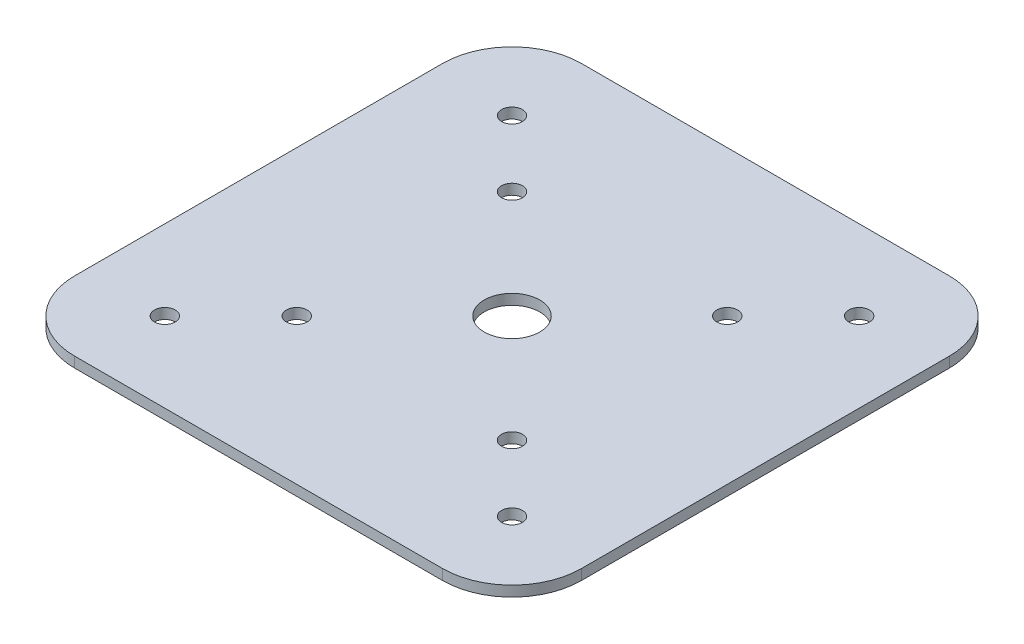
ISO-10303-21;
HEADER;
FILE_DESCRIPTION(('STEP AP214'),'2;1');
FILE_NAME('part.step','',(''),(''),'','','');
FILE_SCHEMA(('AUTOMOTIVE_DESIGN { 1 0 10303 214 1 1 1 1 }'));
ENDSEC;
DATA;
#1=APPLICATION_CONTEXT('core data for automotive mechanical design processes');
#2=APPLICATION_PROTOCOL_DEFINITION('international standard','automotive_design',2000,#1);
#3=PRODUCT_CONTEXT('',#1,'mechanical');
#4=PRODUCT('Part','Part','',(#3));
#5=PRODUCT_RELATED_PRODUCT_CATEGORY('part','',(#4));
#6=PRODUCT_DEFINITION_FORMATION('','',#4);
#7=PRODUCT_DEFINITION_CONTEXT('part definition',#1,'design');
#8=PRODUCT_DEFINITION('design','',#6,#7);
#9=PRODUCT_DEFINITION_SHAPE('','',#8);
#10=(LENGTH_UNIT() NAMED_UNIT(*) SI_UNIT(.MILLI.,.METRE.));
#11=(NAMED_UNIT(*) PLANE_ANGLE_UNIT() SI_UNIT($,.RADIAN.));
#12=(NAMED_UNIT(*) SI_UNIT($,.STERADIAN.) SOLID_ANGLE_UNIT());
#13=UNCERTAINTY_MEASURE_WITH_UNIT(LENGTH_MEASURE(1.E-05),#10,'distance_accuracy_value','');
#14=(GEOMETRIC_REPRESENTATION_CONTEXT(3) GLOBAL_UNCERTAINTY_ASSIGNED_CONTEXT((#13)) GLOBAL_UNIT_ASSIGNED_CONTEXT((#10,
#11,#12)) REPRESENTATION_CONTEXT('',''));
#15=CARTESIAN_POINT('',(0.,0.,0.));
#16=DIRECTION('',(0.,0.,1.));
#17=DIRECTION('',(1.,0.,0.));
#18=AXIS2_PLACEMENT_3D('',#15,#16,#17);
#19=CARTESIAN_POINT('',(0.,1.5,0.));
#20=DIRECTION('',(0.,1.,0.));
#21=DIRECTION('',(0.,0.,1.));
#22=AXIS2_PLACEMENT_3D('',#19,#20,#21);
#23=PLANE('',#22);
#24=CARTESIAN_POINT('',(-25.,1.5,25.));
#25=DIRECTION('',(0.,1.,0.));
#26=DIRECTION('',(0.,0.,1.));
#27=AXIS2_PLACEMENT_3D('',#24,#25,#26);
#28=CIRCLE('',#27,1.50000000000033);
#29=CARTESIAN_POINT('',(-25.,1.5,26.5000000000003));
#30=VERTEX_POINT('',#29);
#31=EDGE_CURVE('E259',#30,#30,#28,.T.);
#32=ORIENTED_EDGE('',*,*,#31,.F.);
#33=EDGE_LOOP('',(#32));
#34=FACE_BOUND('',#33,.T.);
#35=CARTESIAN_POINT('',(25.,1.5,25.));
#36=DIRECTION('',(0.,1.,0.));
#37=DIRECTION('',(0.,0.,1.));
#38=AXIS2_PLACEMENT_3D('',#35,#36,#37);
#39=CIRCLE('',#38,1.50000000000022);
#40=CARTESIAN_POINT('',(25.,1.5,26.5000000000002));
#41=VERTEX_POINT('',#40);
#42=EDGE_CURVE('E267',#41,#41,#39,.T.);
#43=ORIENTED_EDGE('',*,*,#42,.F.);
#44=EDGE_LOOP('',(#43));
#45=FACE_BOUND('',#44,.T.);
#46=CARTESIAN_POINT('',(25.,1.5,-25.));
#47=DIRECTION('',(0.,1.,0.));
#48=DIRECTION('',(0.,0.,1.));
#49=AXIS2_PLACEMENT_3D('',#46,#47,#48);
#50=CIRCLE('',#49,1.50000000000011);
#51=CARTESIAN_POINT('',(25.,1.5,-23.4999999999999));
#52=VERTEX_POINT('',#51);
#53=EDGE_CURVE('E275',#52,#52,#50,.T.);
#54=ORIENTED_EDGE('',*,*,#53,.F.);
#55=EDGE_LOOP('',(#54));
#56=FACE_BOUND('',#55,.T.);
#57=CARTESIAN_POINT('',(-25.,1.5,-25.));
#58=DIRECTION('',(0.,1.,0.));
#59=DIRECTION('',(0.,0.,1.));
#60=AXIS2_PLACEMENT_3D('',#57,#58,#59);
#61=CIRCLE('',#60,1.5);
#62=CARTESIAN_POINT('',(-25.,1.5,-23.5));
#63=VERTEX_POINT('',#62);
#64=EDGE_CURVE('E251',#63,#63,#61,.T.);
#65=ORIENTED_EDGE('',*,*,#64,.F.);
#66=EDGE_LOOP('',(#65));
#67=FACE_BOUND('',#66,.T.);
#68=CARTESIAN_POINT('',(-15.5,1.5,15.5));
#69=DIRECTION('',(0.,1.,0.));
#70=DIRECTION('',(0.,0.,1.));
#71=AXIS2_PLACEMENT_3D('',#68,#69,#70);
#72=CIRCLE('',#71,1.50000000000021);
#73=CARTESIAN_POINT('',(-15.5,1.5,17.0000000000002));
#74=VERTEX_POINT('',#73);
#75=EDGE_CURVE('E227',#74,#74,#72,.T.);
#76=ORIENTED_EDGE('',*,*,#75,.F.);
#77=EDGE_LOOP('',(#76));
#78=FACE_BOUND('',#77,.T.);
#79=CARTESIAN_POINT('',(15.5,1.5,15.5));
#80=DIRECTION('',(0.,1.,0.));
#81=DIRECTION('',(0.,0.,1.));
#82=AXIS2_PLACEMENT_3D('',#79,#80,#81);
#83=CIRCLE('',#82,1.50000000000014);
#84=CARTESIAN_POINT('',(15.5,1.5,17.0000000000001));
#85=VERTEX_POINT('',#84);
#86=EDGE_CURVE('E236',#85,#85,#83,.T.);
#87=ORIENTED_EDGE('',*,*,#86,.F.);
#88=EDGE_LOOP('',(#87));
#89=FACE_BOUND('',#88,.T.);
#90=CARTESIAN_POINT('',(15.5,1.5,-15.5));
#91=DIRECTION('',(0.,1.,0.));
#92=DIRECTION('',(0.,0.,1.));
#93=AXIS2_PLACEMENT_3D('',#90,#91,#92);
#94=CIRCLE('',#93,1.50000000000007);
#95=CARTESIAN_POINT('',(15.5,1.5,-13.9999999999999));
#96=VERTEX_POINT('',#95);
#97=EDGE_CURVE('E244',#96,#96,#94,.T.);
#98=ORIENTED_EDGE('',*,*,#97,.F.);
#99=EDGE_LOOP('',(#98));
#100=FACE_BOUND('',#99,.T.);
#101=CARTESIAN_POINT('',(-15.5,1.5,-15.5));
#102=DIRECTION('',(0.,1.,0.));
#103=DIRECTION('',(0.,0.,1.));
#104=AXIS2_PLACEMENT_3D('',#101,#102,#103);
#105=CIRCLE('',#104,1.5);
#106=CARTESIAN_POINT('',(-15.5,1.5,-14.));
#107=VERTEX_POINT('',#106);
#108=EDGE_CURVE('E219',#107,#107,#105,.T.);
#109=ORIENTED_EDGE('',*,*,#108,.F.);
#110=EDGE_LOOP('',(#109));
#111=FACE_BOUND('',#110,.T.);
#112=DIRECTION('',(1.,0.,0.));
#113=VECTOR('',#112,1.);
#114=CARTESIAN_POINT('',(-36.5,1.5,36.5));
#115=LINE('',#114,#113);
#116=CARTESIAN_POINT('',(-26.5,1.5,36.5));
#117=VERTEX_POINT('',#116);
#118=CARTESIAN_POINT('',(26.5,1.5,36.5));
#119=VERTEX_POINT('',#118);
#120=EDGE_CURVE('E149',#117,#119,#115,.T.);
#121=ORIENTED_EDGE('',*,*,#120,.T.);
#122=CARTESIAN_POINT('',(26.5,1.5,26.5));
#123=DIRECTION('',(0.,1.,0.));
#124=DIRECTION('',(0.,0.,1.));
#125=AXIS2_PLACEMENT_3D('',#122,#123,#124);
#126=CIRCLE('',#125,10.);
#127=CARTESIAN_POINT('',(36.5,1.5,26.5));
#128=VERTEX_POINT('',#127);
#129=EDGE_CURVE('E178',#119,#128,#126,.T.);
#130=ORIENTED_EDGE('',*,*,#129,.T.);
#131=DIRECTION('',(0.,0.,-1.));
#132=VECTOR('',#131,1.);
#133=CARTESIAN_POINT('',(36.5,1.5,-36.5));
#134=LINE('',#133,#132);
#135=CARTESIAN_POINT('',(36.5,1.5,-26.5));
#136=VERTEX_POINT('',#135);
#137=EDGE_CURVE('E127',#128,#136,#134,.T.);
#138=ORIENTED_EDGE('',*,*,#137,.T.);
#139=CARTESIAN_POINT('',(26.5,1.5,-26.5));
#140=DIRECTION('',(0.,1.,0.));
#141=DIRECTION('',(0.,0.,1.));
#142=AXIS2_PLACEMENT_3D('',#139,#140,#141);
#143=CIRCLE('',#142,10.);
#144=CARTESIAN_POINT('',(26.5,1.5,-36.5));
#145=VERTEX_POINT('',#144);
#146=EDGE_CURVE('E172',#136,#145,#143,.T.);
#147=ORIENTED_EDGE('',*,*,#146,.T.);
#148=DIRECTION('',(-1.,0.,0.));
#149=VECTOR('',#148,1.);
#150=CARTESIAN_POINT('',(-36.5,1.5,-36.5));
#151=LINE('',#150,#149);
#152=CARTESIAN_POINT('',(-26.5,1.5,-36.5));
#153=VERTEX_POINT('',#152);
#154=EDGE_CURVE('E191',#145,#153,#151,.T.);
#155=ORIENTED_EDGE('',*,*,#154,.T.);
#156=CARTESIAN_POINT('',(-26.5,1.5,-26.5));
#157=DIRECTION('',(0.,1.,0.));
#158=DIRECTION('',(0.,0.,1.));
#159=AXIS2_PLACEMENT_3D('',#156,#157,#158);
#160=CIRCLE('',#159,10.);
#161=CARTESIAN_POINT('',(-36.5,1.5,-26.5));
#162=VERTEX_POINT('',#161);
#163=EDGE_CURVE('E61',#153,#162,#160,.T.);
#164=ORIENTED_EDGE('',*,*,#163,.T.);
#165=DIRECTION('',(0.,0.,1.));
#166=VECTOR('',#165,1.);
#167=CARTESIAN_POINT('',(-36.5,1.5,-36.5));
#168=LINE('',#167,#166);
#169=CARTESIAN_POINT('',(-36.5,1.5,26.5));
#170=VERTEX_POINT('',#169);
#171=EDGE_CURVE('E198',#162,#170,#168,.T.);
#172=ORIENTED_EDGE('',*,*,#171,.T.);
#173=CARTESIAN_POINT('',(-26.5,1.5,26.5));
#174=DIRECTION('',(0.,1.,0.));
#175=DIRECTION('',(0.,0.,1.));
#176=AXIS2_PLACEMENT_3D('',#173,#174,#175);
#177=CIRCLE('',#176,10.);
#178=EDGE_CURVE('E175',#170,#117,#177,.T.);
#179=ORIENTED_EDGE('',*,*,#178,.T.);
#180=EDGE_LOOP('',(#121,#130,#138,#147,#155,#164,#172,#179));
#181=FACE_BOUND('',#180,.T.);
#182=CARTESIAN_POINT('',(0.,1.5,0.));
#183=DIRECTION('',(0.,1.,0.));
#184=DIRECTION('',(0.,0.,1.));
#185=AXIS2_PLACEMENT_3D('',#182,#183,#184);
#186=CIRCLE('',#185,4.);
#187=CARTESIAN_POINT('',(0.,1.5,4.00000000000001));
#188=VERTEX_POINT('',#187);
#189=EDGE_CURVE('E138',#188,#188,#186,.T.);
#190=ORIENTED_EDGE('',*,*,#189,.F.);
#191=EDGE_LOOP('',(#190));
#192=FACE_BOUND('',#191,.T.);
#193=ADVANCED_FACE('F38',(#34,#45,#56,#67,#78,#89,#100,#111,#181,#192),#23,.T.);
#194=CARTESIAN_POINT('',(0.,0.,0.));
#195=DIRECTION('',(0.,1.,0.));
#196=DIRECTION('',(0.,0.,1.));
#197=AXIS2_PLACEMENT_3D('',#194,#195,#196);
#198=PLANE('',#197);
#199=CARTESIAN_POINT('',(-25.,0.,25.));
#200=DIRECTION('',(0.,1.,0.));
#201=DIRECTION('',(0.,0.,1.));
#202=AXIS2_PLACEMENT_3D('',#199,#200,#201);
#203=CIRCLE('',#202,1.50000000000033);
#204=CARTESIAN_POINT('',(-25.,0.,26.5000000000003));
#205=VERTEX_POINT('',#204);
#206=EDGE_CURVE('E263',#205,#205,#203,.T.);
#207=ORIENTED_EDGE('',*,*,#206,.T.);
#208=EDGE_LOOP('',(#207));
#209=FACE_BOUND('',#208,.T.);
#210=CARTESIAN_POINT('',(25.,0.,25.));
#211=DIRECTION('',(0.,1.,0.));
#212=DIRECTION('',(0.,0.,1.));
#213=AXIS2_PLACEMENT_3D('',#210,#211,#212);
#214=CIRCLE('',#213,1.50000000000022);
#215=CARTESIAN_POINT('',(25.,0.,26.5000000000002));
#216=VERTEX_POINT('',#215);
#217=EDGE_CURVE('E271',#216,#216,#214,.T.);
#218=ORIENTED_EDGE('',*,*,#217,.T.);
#219=EDGE_LOOP('',(#218));
#220=FACE_BOUND('',#219,.T.);
#221=CARTESIAN_POINT('',(25.,0.,-25.));
#222=DIRECTION('',(0.,1.,0.));
#223=DIRECTION('',(0.,0.,1.));
#224=AXIS2_PLACEMENT_3D('',#221,#222,#223);
#225=CIRCLE('',#224,1.50000000000011);
#226=CARTESIAN_POINT('',(25.,0.,-23.4999999999999));
#227=VERTEX_POINT('',#226);
#228=EDGE_CURVE('E255',#227,#227,#225,.T.);
#229=ORIENTED_EDGE('',*,*,#228,.T.);
#230=EDGE_LOOP('',(#229));
#231=FACE_BOUND('',#230,.T.);
#232=CARTESIAN_POINT('',(-25.,0.,-25.));
#233=DIRECTION('',(0.,1.,0.));
#234=DIRECTION('',(0.,0.,1.));
#235=AXIS2_PLACEMENT_3D('',#232,#233,#234);
#236=CIRCLE('',#235,1.5);
#237=CARTESIAN_POINT('',(-25.,0.,-23.5));
#238=VERTEX_POINT('',#237);
#239=EDGE_CURVE('E232',#238,#238,#236,.T.);
#240=ORIENTED_EDGE('',*,*,#239,.T.);
#241=EDGE_LOOP('',(#240));
#242=FACE_BOUND('',#241,.T.);
#243=CARTESIAN_POINT('',(-15.5,0.,15.5));
#244=DIRECTION('',(0.,1.,0.));
#245=DIRECTION('',(0.,0.,1.));
#246=AXIS2_PLACEMENT_3D('',#243,#244,#245);
#247=CIRCLE('',#246,1.50000000000021);
#248=CARTESIAN_POINT('',(-15.5,0.,17.0000000000002));
#249=VERTEX_POINT('',#248);
#250=EDGE_CURVE('E231',#249,#249,#247,.T.);
#251=ORIENTED_EDGE('',*,*,#250,.T.);
#252=EDGE_LOOP('',(#251));
#253=FACE_BOUND('',#252,.T.);
#254=CARTESIAN_POINT('',(15.5,0.,15.5));
#255=DIRECTION('',(0.,1.,0.));
#256=DIRECTION('',(0.,0.,1.));
#257=AXIS2_PLACEMENT_3D('',#254,#255,#256);
#258=CIRCLE('',#257,1.50000000000014);
#259=CARTESIAN_POINT('',(15.5,0.,17.0000000000001));
#260=VERTEX_POINT('',#259);
#261=EDGE_CURVE('E240',#260,#260,#258,.T.);
#262=ORIENTED_EDGE('',*,*,#261,.T.);
#263=EDGE_LOOP('',(#262));
#264=FACE_BOUND('',#263,.T.);
#265=CARTESIAN_POINT('',(15.5,0.,-15.5));
#266=DIRECTION('',(0.,1.,0.));
#267=DIRECTION('',(0.,0.,1.));
#268=AXIS2_PLACEMENT_3D('',#265,#266,#267);
#269=CIRCLE('',#268,1.50000000000007);
#270=CARTESIAN_POINT('',(15.5,0.,-13.9999999999999));
#271=VERTEX_POINT('',#270);
#272=EDGE_CURVE('E223',#271,#271,#269,.T.);
#273=ORIENTED_EDGE('',*,*,#272,.T.);
#274=EDGE_LOOP('',(#273));
#275=FACE_BOUND('',#274,.T.);
#276=CARTESIAN_POINT('',(-15.5,0.,-15.5));
#277=DIRECTION('',(0.,1.,0.));
#278=DIRECTION('',(0.,0.,1.));
#279=AXIS2_PLACEMENT_3D('',#276,#277,#278);
#280=CIRCLE('',#279,1.5);
#281=CARTESIAN_POINT('',(-15.5,0.,-14.));
#282=VERTEX_POINT('',#281);
#283=EDGE_CURVE('E217',#282,#282,#280,.T.);
#284=ORIENTED_EDGE('',*,*,#283,.T.);
#285=EDGE_LOOP('',(#284));
#286=FACE_BOUND('',#285,.T.);
#287=DIRECTION('',(0.,0.,-1.));
#288=VECTOR('',#287,1.);
#289=CARTESIAN_POINT('',(36.5,0.,-36.5));
#290=LINE('',#289,#288);
#291=CARTESIAN_POINT('',(36.5,0.,26.5));
#292=VERTEX_POINT('',#291);
#293=CARTESIAN_POINT('',(36.5,0.,-26.5));
#294=VERTEX_POINT('',#293);
#295=EDGE_CURVE('E124',#292,#294,#290,.T.);
#296=ORIENTED_EDGE('',*,*,#295,.F.);
#297=CARTESIAN_POINT('',(26.5,0.,26.5));
#298=DIRECTION('',(0.,1.,0.));
#299=DIRECTION('',(0.,0.,1.));
#300=AXIS2_PLACEMENT_3D('',#297,#298,#299);
#301=CIRCLE('',#300,10.);
#302=CARTESIAN_POINT('',(26.5,0.,36.5));
#303=VERTEX_POINT('',#302);
#304=EDGE_CURVE('E106',#292,#303,#301,.F.);
#305=ORIENTED_EDGE('',*,*,#304,.T.);
#306=DIRECTION('',(1.,0.,0.));
#307=VECTOR('',#306,1.);
#308=CARTESIAN_POINT('',(-36.5,0.,36.5));
#309=LINE('',#308,#307);
#310=CARTESIAN_POINT('',(-26.5,0.,36.5));
#311=VERTEX_POINT('',#310);
#312=EDGE_CURVE('E154',#311,#303,#309,.T.);
#313=ORIENTED_EDGE('',*,*,#312,.F.);
#314=CARTESIAN_POINT('',(-26.5,0.,26.5));
#315=DIRECTION('',(0.,1.,0.));
#316=DIRECTION('',(0.,0.,1.));
#317=AXIS2_PLACEMENT_3D('',#314,#315,#316);
#318=CIRCLE('',#317,10.);
#319=CARTESIAN_POINT('',(-36.5,0.,26.5));
#320=VERTEX_POINT('',#319);
#321=EDGE_CURVE('E118',#311,#320,#318,.F.);
#322=ORIENTED_EDGE('',*,*,#321,.T.);
#323=DIRECTION('',(0.,0.,1.));
#324=VECTOR('',#323,1.);
#325=CARTESIAN_POINT('',(-36.5,0.,-36.5));
#326=LINE('',#325,#324);
#327=CARTESIAN_POINT('',(-36.5,0.,-26.5));
#328=VERTEX_POINT('',#327);
#329=EDGE_CURVE('E143',#328,#320,#326,.T.);
#330=ORIENTED_EDGE('',*,*,#329,.F.);
#331=CARTESIAN_POINT('',(-26.5,0.,-26.5));
#332=DIRECTION('',(0.,1.,0.));
#333=DIRECTION('',(0.,0.,1.));
#334=AXIS2_PLACEMENT_3D('',#331,#332,#333);
#335=CIRCLE('',#334,10.);
#336=CARTESIAN_POINT('',(-26.5,0.,-36.5));
#337=VERTEX_POINT('',#336);
#338=EDGE_CURVE('E129',#328,#337,#335,.F.);
#339=ORIENTED_EDGE('',*,*,#338,.T.);
#340=DIRECTION('',(-1.,0.,0.));
#341=VECTOR('',#340,1.);
#342=CARTESIAN_POINT('',(-36.5,0.,-36.5));
#343=LINE('',#342,#341);
#344=CARTESIAN_POINT('',(26.5,0.,-36.5));
#345=VERTEX_POINT('',#344);
#346=EDGE_CURVE('E137',#345,#337,#343,.T.);
#347=ORIENTED_EDGE('',*,*,#346,.F.);
#348=CARTESIAN_POINT('',(26.5,0.,-26.5));
#349=DIRECTION('',(0.,1.,0.));
#350=DIRECTION('',(0.,0.,1.));
#351=AXIS2_PLACEMENT_3D('',#348,#349,#350);
#352=CIRCLE('',#351,10.);
#353=EDGE_CURVE('E135',#345,#294,#352,.F.);
#354=ORIENTED_EDGE('',*,*,#353,.T.);
#355=EDGE_LOOP('',(#296,#305,#313,#322,#330,#339,#347,#354));
#356=FACE_BOUND('',#355,.T.);
#357=CARTESIAN_POINT('',(0.,0.,0.));
#358=DIRECTION('',(0.,1.,0.));
#359=DIRECTION('',(0.,0.,1.));
#360=AXIS2_PLACEMENT_3D('',#357,#358,#359);
#361=CIRCLE('',#360,4.);
#362=CARTESIAN_POINT('',(0.,0.,4.00000000000001));
#363=VERTEX_POINT('',#362);
#364=EDGE_CURVE('E146',#363,#363,#361,.T.);
#365=ORIENTED_EDGE('',*,*,#364,.T.);
#366=EDGE_LOOP('',(#365));
#367=FACE_BOUND('',#366,.T.);
#368=ADVANCED_FACE('F132',(#209,#220,#231,#242,#253,#264,#275,#286,#356,#367),#198,.F.);
#369=CARTESIAN_POINT('',(36.5,1.5,-36.5));
#370=DIRECTION('',(-1.,0.,0.));
#371=DIRECTION('',(0.,0.,1.));
#372=AXIS2_PLACEMENT_3D('',#369,#370,#371);
#373=PLANE('',#372);
#374=ORIENTED_EDGE('',*,*,#137,.F.);
#375=DIRECTION('',(0.,-1.,0.));
#376=VECTOR('',#375,1.);
#377=CARTESIAN_POINT('',(36.5,1.5,26.5));
#378=LINE('',#377,#376);
#379=EDGE_CURVE('E110',#128,#292,#378,.T.);
#380=ORIENTED_EDGE('',*,*,#379,.T.);
#381=ORIENTED_EDGE('',*,*,#295,.T.);
#382=DIRECTION('',(0.,-1.,0.));
#383=VECTOR('',#382,1.);
#384=CARTESIAN_POINT('',(36.5,1.5,-26.5));
#385=LINE('',#384,#383);
#386=EDGE_CURVE('E130',#294,#136,#385,.F.);
#387=ORIENTED_EDGE('',*,*,#386,.T.);
#388=EDGE_LOOP('',(#374,#380,#381,#387));
#389=FACE_BOUND('',#388,.T.);
#390=ADVANCED_FACE('F123',(#389),#373,.F.);
#391=CARTESIAN_POINT('',(-36.5,1.5,-36.5));
#392=DIRECTION('',(0.,0.,1.));
#393=DIRECTION('',(1.,0.,0.));
#394=AXIS2_PLACEMENT_3D('',#391,#392,#393);
#395=PLANE('',#394);
#396=ORIENTED_EDGE('',*,*,#154,.F.);
#397=DIRECTION('',(0.,-1.,0.));
#398=VECTOR('',#397,1.);
#399=CARTESIAN_POINT('',(26.5,1.5,-36.5));
#400=LINE('',#399,#398);
#401=EDGE_CURVE('E11',#145,#345,#400,.T.);
#402=ORIENTED_EDGE('',*,*,#401,.T.);
#403=ORIENTED_EDGE('',*,*,#346,.T.);
#404=DIRECTION('',(0.,-1.,0.));
#405=VECTOR('',#404,1.);
#406=CARTESIAN_POINT('',(-26.5,1.5,-36.5));
#407=LINE('',#406,#405);
#408=EDGE_CURVE('E47',#337,#153,#407,.F.);
#409=ORIENTED_EDGE('',*,*,#408,.T.);
#410=EDGE_LOOP('',(#396,#402,#403,#409));
#411=FACE_BOUND('',#410,.T.);
#412=ADVANCED_FACE('F190',(#411),#395,.F.);
#413=CARTESIAN_POINT('',(-36.5,1.5,-36.5));
#414=DIRECTION('',(1.,0.,0.));
#415=DIRECTION('',(0.,0.,-1.));
#416=AXIS2_PLACEMENT_3D('',#413,#414,#415);
#417=PLANE('',#416);
#418=ORIENTED_EDGE('',*,*,#329,.T.);
#419=DIRECTION('',(0.,-1.,0.));
#420=VECTOR('',#419,1.);
#421=CARTESIAN_POINT('',(-36.5,1.5,26.5));
#422=LINE('',#421,#420);
#423=EDGE_CURVE('E54',#320,#170,#422,.F.);
#424=ORIENTED_EDGE('',*,*,#423,.T.);
#425=ORIENTED_EDGE('',*,*,#171,.F.);
#426=DIRECTION('',(0.,-1.,0.));
#427=VECTOR('',#426,1.);
#428=CARTESIAN_POINT('',(-36.5,1.5,-26.5));
#429=LINE('',#428,#427);
#430=EDGE_CURVE('E181',#162,#328,#429,.T.);
#431=ORIENTED_EDGE('',*,*,#430,.T.);
#432=EDGE_LOOP('',(#418,#424,#425,#431));
#433=FACE_BOUND('',#432,.T.);
#434=ADVANCED_FACE('F202',(#433),#417,.F.);
#435=CARTESIAN_POINT('',(-36.5,1.5,36.5));
#436=DIRECTION('',(0.,0.,-1.));
#437=DIRECTION('',(-1.,0.,0.));
#438=AXIS2_PLACEMENT_3D('',#435,#436,#437);
#439=PLANE('',#438);
#440=ORIENTED_EDGE('',*,*,#312,.T.);
#441=DIRECTION('',(0.,-1.,0.));
#442=VECTOR('',#441,1.);
#443=CARTESIAN_POINT('',(26.5,1.5,36.5));
#444=LINE('',#443,#442);
#445=EDGE_CURVE('E111',#303,#119,#444,.F.);
#446=ORIENTED_EDGE('',*,*,#445,.T.);
#447=ORIENTED_EDGE('',*,*,#120,.F.);
#448=DIRECTION('',(0.,-1.,0.));
#449=VECTOR('',#448,1.);
#450=CARTESIAN_POINT('',(-26.5,1.5,36.5));
#451=LINE('',#450,#449);
#452=EDGE_CURVE('E117',#117,#311,#451,.T.);
#453=ORIENTED_EDGE('',*,*,#452,.T.);
#454=EDGE_LOOP('',(#440,#446,#447,#453));
#455=FACE_BOUND('',#454,.T.);
#456=ADVANCED_FACE('F209',(#455),#439,.F.);
#457=CARTESIAN_POINT('',(0.,1.5,0.));
#458=DIRECTION('',(0.,-1.,0.));
#459=DIRECTION('',(0.,0.,-1.));
#460=AXIS2_PLACEMENT_3D('',#457,#458,#459);
#461=CYLINDRICAL_SURFACE('',#460,4.);
#462=ORIENTED_EDGE('',*,*,#189,.T.);
#463=EDGE_LOOP('',(#462));
#464=FACE_BOUND('',#463,.T.);
#465=ORIENTED_EDGE('',*,*,#364,.F.);
#466=EDGE_LOOP('',(#465));
#467=FACE_BOUND('',#466,.T.);
#468=ADVANCED_FACE('F310',(#464,#467),#461,.F.);
#469=CARTESIAN_POINT('',(-15.5,0.,-15.5));
#470=DIRECTION('',(0.,1.,0.));
#471=DIRECTION('',(0.,0.,1.));
#472=AXIS2_PLACEMENT_3D('',#469,#470,#471);
#473=CYLINDRICAL_SURFACE('',#472,1.5);
#474=ORIENTED_EDGE('',*,*,#283,.F.);
#475=EDGE_LOOP('',(#474));
#476=FACE_BOUND('',#475,.T.);
#477=ORIENTED_EDGE('',*,*,#108,.T.);
#478=EDGE_LOOP('',(#477));
#479=FACE_BOUND('',#478,.T.);
#480=ADVANCED_FACE('F307',(#476,#479),#473,.F.);
#481=CARTESIAN_POINT('',(15.5,0.,-15.5));
#482=DIRECTION('',(0.,1.,0.));
#483=DIRECTION('',(0.,0.,1.));
#484=AXIS2_PLACEMENT_3D('',#481,#482,#483);
#485=CYLINDRICAL_SURFACE('',#484,1.50000000000007);
#486=ORIENTED_EDGE('',*,*,#272,.F.);
#487=EDGE_LOOP('',(#486));
#488=FACE_BOUND('',#487,.T.);
#489=ORIENTED_EDGE('',*,*,#97,.T.);
#490=EDGE_LOOP('',(#489));
#491=FACE_BOUND('',#490,.T.);
#492=ADVANCED_FACE('F309',(#488,#491),#485,.F.);
#493=CARTESIAN_POINT('',(15.5,0.,15.5));
#494=DIRECTION('',(0.,1.,0.));
#495=DIRECTION('',(0.,0.,1.));
#496=AXIS2_PLACEMENT_3D('',#493,#494,#495);
#497=CYLINDRICAL_SURFACE('',#496,1.50000000000014);
#498=ORIENTED_EDGE('',*,*,#261,.F.);
#499=EDGE_LOOP('',(#498));
#500=FACE_BOUND('',#499,.T.);
#501=ORIENTED_EDGE('',*,*,#86,.T.);
#502=EDGE_LOOP('',(#501));
#503=FACE_BOUND('',#502,.T.);
#504=ADVANCED_FACE('F317',(#500,#503),#497,.F.);
#505=CARTESIAN_POINT('',(-15.5,0.,15.5));
#506=DIRECTION('',(0.,1.,0.));
#507=DIRECTION('',(0.,0.,1.));
#508=AXIS2_PLACEMENT_3D('',#505,#506,#507);
#509=CYLINDRICAL_SURFACE('',#508,1.50000000000021);
#510=ORIENTED_EDGE('',*,*,#250,.F.);
#511=EDGE_LOOP('',(#510));
#512=FACE_BOUND('',#511,.T.);
#513=ORIENTED_EDGE('',*,*,#75,.T.);
#514=EDGE_LOOP('',(#513));
#515=FACE_BOUND('',#514,.T.);
#516=ADVANCED_FACE('F324',(#512,#515),#509,.F.);
#517=CARTESIAN_POINT('',(-25.,0.,-25.));
#518=DIRECTION('',(0.,1.,0.));
#519=DIRECTION('',(0.,0.,1.));
#520=AXIS2_PLACEMENT_3D('',#517,#518,#519);
#521=CYLINDRICAL_SURFACE('',#520,1.5);
#522=ORIENTED_EDGE('',*,*,#239,.F.);
#523=EDGE_LOOP('',(#522));
#524=FACE_BOUND('',#523,.T.);
#525=ORIENTED_EDGE('',*,*,#64,.T.);
#526=EDGE_LOOP('',(#525));
#527=FACE_BOUND('',#526,.T.);
#528=ADVANCED_FACE('F289',(#524,#527),#521,.F.);
#529=CARTESIAN_POINT('',(25.,0.,-25.));
#530=DIRECTION('',(0.,1.,0.));
#531=DIRECTION('',(0.,0.,1.));
#532=AXIS2_PLACEMENT_3D('',#529,#530,#531);
#533=CYLINDRICAL_SURFACE('',#532,1.50000000000011);
#534=ORIENTED_EDGE('',*,*,#228,.F.);
#535=EDGE_LOOP('',(#534));
#536=FACE_BOUND('',#535,.T.);
#537=ORIENTED_EDGE('',*,*,#53,.T.);
#538=EDGE_LOOP('',(#537));
#539=FACE_BOUND('',#538,.T.);
#540=ADVANCED_FACE('F285',(#536,#539),#533,.F.);
#541=CARTESIAN_POINT('',(25.,0.,25.));
#542=DIRECTION('',(0.,1.,0.));
#543=DIRECTION('',(0.,0.,1.));
#544=AXIS2_PLACEMENT_3D('',#541,#542,#543);
#545=CYLINDRICAL_SURFACE('',#544,1.50000000000022);
#546=ORIENTED_EDGE('',*,*,#217,.F.);
#547=EDGE_LOOP('',(#546));
#548=FACE_BOUND('',#547,.T.);
#549=ORIENTED_EDGE('',*,*,#42,.T.);
#550=EDGE_LOOP('',(#549));
#551=FACE_BOUND('',#550,.T.);
#552=ADVANCED_FACE('F288',(#548,#551),#545,.F.);
#553=CARTESIAN_POINT('',(-25.,0.,25.));
#554=DIRECTION('',(0.,1.,0.));
#555=DIRECTION('',(0.,0.,1.));
#556=AXIS2_PLACEMENT_3D('',#553,#554,#555);
#557=CYLINDRICAL_SURFACE('',#556,1.50000000000033);
#558=ORIENTED_EDGE('',*,*,#206,.F.);
#559=EDGE_LOOP('',(#558));
#560=FACE_BOUND('',#559,.T.);
#561=ORIENTED_EDGE('',*,*,#31,.T.);
#562=EDGE_LOOP('',(#561));
#563=FACE_BOUND('',#562,.T.);
#564=ADVANCED_FACE('F340',(#560,#563),#557,.F.);
#565=CARTESIAN_POINT('',(26.5,1.5,26.5));
#566=DIRECTION('',(0.,-1.,0.));
#567=DIRECTION('',(0.,0.,-1.));
#568=AXIS2_PLACEMENT_3D('',#565,#566,#567);
#569=CYLINDRICAL_SURFACE('',#568,10.);
#570=ORIENTED_EDGE('',*,*,#129,.F.);
#571=ORIENTED_EDGE('',*,*,#445,.F.);
#572=ORIENTED_EDGE('',*,*,#304,.F.);
#573=ORIENTED_EDGE('',*,*,#379,.F.);
#574=EDGE_LOOP('',(#570,#571,#572,#573));
#575=FACE_BOUND('',#574,.T.);
#576=ADVANCED_FACE('F109',(#575),#569,.T.);
#577=CARTESIAN_POINT('',(-26.5,1.5,26.5));
#578=DIRECTION('',(0.,-1.,0.));
#579=DIRECTION('',(0.,0.,-1.));
#580=AXIS2_PLACEMENT_3D('',#577,#578,#579);
#581=CYLINDRICAL_SURFACE('',#580,10.);
#582=ORIENTED_EDGE('',*,*,#178,.F.);
#583=ORIENTED_EDGE('',*,*,#423,.F.);
#584=ORIENTED_EDGE('',*,*,#321,.F.);
#585=ORIENTED_EDGE('',*,*,#452,.F.);
#586=EDGE_LOOP('',(#582,#583,#584,#585));
#587=FACE_BOUND('',#586,.T.);
#588=ADVANCED_FACE('F206',(#587),#581,.T.);
#589=CARTESIAN_POINT('',(26.5,1.5,-26.5));
#590=DIRECTION('',(0.,-1.,0.));
#591=DIRECTION('',(0.,0.,-1.));
#592=AXIS2_PLACEMENT_3D('',#589,#590,#591);
#593=CYLINDRICAL_SURFACE('',#592,10.);
#594=ORIENTED_EDGE('',*,*,#146,.F.);
#595=ORIENTED_EDGE('',*,*,#386,.F.);
#596=ORIENTED_EDGE('',*,*,#353,.F.);
#597=ORIENTED_EDGE('',*,*,#401,.F.);
#598=EDGE_LOOP('',(#594,#595,#596,#597));
#599=FACE_BOUND('',#598,.T.);
#600=ADVANCED_FACE('F342',(#599),#593,.T.);
#601=CARTESIAN_POINT('',(-26.5,1.5,-26.5));
#602=DIRECTION('',(0.,-1.,0.));
#603=DIRECTION('',(0.,0.,-1.));
#604=AXIS2_PLACEMENT_3D('',#601,#602,#603);
#605=CYLINDRICAL_SURFACE('',#604,10.);
#606=ORIENTED_EDGE('',*,*,#163,.F.);
#607=ORIENTED_EDGE('',*,*,#408,.F.);
#608=ORIENTED_EDGE('',*,*,#338,.F.);
#609=ORIENTED_EDGE('',*,*,#430,.F.);
#610=EDGE_LOOP('',(#606,#607,#608,#609));
#611=FACE_BOUND('',#610,.T.);
#612=ADVANCED_FACE('F40',(#611),#605,.T.);
#613=CLOSED_SHELL('',(#193,#368,#390,#412,#434,#456,#468,#480,#492,#504,#516,#528,#540,#552,
#564,#576,#588,#600,#612));
#614=MANIFOLD_SOLID_BREP('B2',#613);
#615=ADVANCED_BREP_SHAPE_REPRESENTATION('',(#18,#614),#14);
#616=SHAPE_DEFINITION_REPRESENTATION(#9,#615);
ENDSEC;
END-ISO-10303-21;
